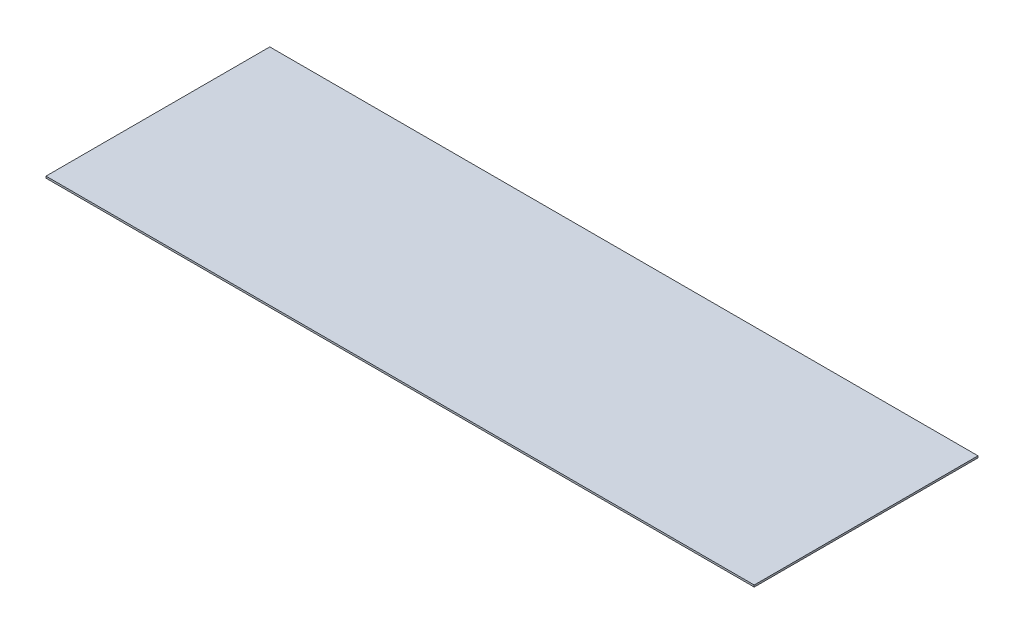
ISO-10303-21;
HEADER;
FILE_DESCRIPTION(('STEP AP214'),'2;1');
FILE_NAME('part.step','',(''),(''),'','','');
FILE_SCHEMA(('AUTOMOTIVE_DESIGN { 1 0 10303 214 1 1 1 1 }'));
ENDSEC;
DATA;
#1=APPLICATION_CONTEXT('core data for automotive mechanical design processes');
#2=APPLICATION_PROTOCOL_DEFINITION('international standard','automotive_design',2000,#1);
#3=PRODUCT_CONTEXT('',#1,'mechanical');
#4=PRODUCT('Part','Part','',(#3));
#5=PRODUCT_RELATED_PRODUCT_CATEGORY('part','',(#4));
#6=PRODUCT_DEFINITION_FORMATION('','',#4);
#7=PRODUCT_DEFINITION_CONTEXT('part definition',#1,'design');
#8=PRODUCT_DEFINITION('design','',#6,#7);
#9=PRODUCT_DEFINITION_SHAPE('','',#8);
#10=(LENGTH_UNIT() NAMED_UNIT(*) SI_UNIT(.MILLI.,.METRE.));
#11=(NAMED_UNIT(*) PLANE_ANGLE_UNIT() SI_UNIT($,.RADIAN.));
#12=(NAMED_UNIT(*) SI_UNIT($,.STERADIAN.) SOLID_ANGLE_UNIT());
#13=UNCERTAINTY_MEASURE_WITH_UNIT(LENGTH_MEASURE(1.E-05),#10,'distance_accuracy_value','');
#14=(GEOMETRIC_REPRESENTATION_CONTEXT(3) GLOBAL_UNCERTAINTY_ASSIGNED_CONTEXT((#13)) GLOBAL_UNIT_ASSIGNED_CONTEXT((#10,
#11,#12)) REPRESENTATION_CONTEXT('',''));
#15=CARTESIAN_POINT('',(0.,0.,0.));
#16=DIRECTION('',(0.,0.,1.));
#17=DIRECTION('',(1.,0.,0.));
#18=AXIS2_PLACEMENT_3D('',#15,#16,#17);
#19=CARTESIAN_POINT('',(-609.4095,1.94289029309402E-13,193.675));
#20=DIRECTION('',(0.,-1.,0.));
#21=DIRECTION('',(0.,0.,-1.));
#22=AXIS2_PLACEMENT_3D('',#19,#20,#21);
#23=PLANE('',#22);
#24=DIRECTION('',(1.,0.,0.));
#25=VECTOR('',#24,1.);
#26=CARTESIAN_POINT('',(-609.406717173755,1.94289029309402E-13,0.));
#27=LINE('',#26,#25);
#28=CARTESIAN_POINT('',(3.55600000000012,1.94289029309402E-13,0.));
#29=VERTEX_POINT('',#28);
#30=CARTESIAN_POINT('',(-1222.375,1.94289029309402E-13,0.));
#31=VERTEX_POINT('',#30);
#32=EDGE_CURVE('E78',#29,#31,#27,.F.);
#33=ORIENTED_EDGE('',*,*,#32,.T.);
#34=DIRECTION('',(0.,0.,-1.));
#35=VECTOR('',#34,1.);
#36=CARTESIAN_POINT('',(-1222.375,1.94289029309402E-13,193.675));
#37=LINE('',#36,#35);
#38=CARTESIAN_POINT('',(-1222.375,1.94289029309402E-13,387.35));
#39=VERTEX_POINT('',#38);
#40=EDGE_CURVE('E58',#31,#39,#37,.F.);
#41=ORIENTED_EDGE('',*,*,#40,.T.);
#42=DIRECTION('',(1.,0.,0.));
#43=VECTOR('',#42,1.);
#44=CARTESIAN_POINT('',(-609.406717173755,1.94289029309402E-13,387.35));
#45=LINE('',#44,#43);
#46=CARTESIAN_POINT('',(3.55600000000011,1.94289029309402E-13,387.35));
#47=VERTEX_POINT('',#46);
#48=EDGE_CURVE('E52',#47,#39,#45,.F.);
#49=ORIENTED_EDGE('',*,*,#48,.F.);
#50=DIRECTION('',(0.,0.,-1.));
#51=VECTOR('',#50,1.);
#52=CARTESIAN_POINT('',(3.55600000000011,1.94289029309402E-13,193.675));
#53=LINE('',#52,#51);
#54=EDGE_CURVE('E17',#29,#47,#53,.F.);
#55=ORIENTED_EDGE('',*,*,#54,.F.);
#56=EDGE_LOOP('',(#33,#41,#49,#55));
#57=FACE_BOUND('',#56,.T.);
#58=ADVANCED_FACE('F14',(#57),#23,.F.);
#59=CARTESIAN_POINT('',(3.55600000000011,-3.1749999999998,193.675));
#60=DIRECTION('',(1.,0.,0.));
#61=DIRECTION('',(0.,0.,-1.));
#62=AXIS2_PLACEMENT_3D('',#59,#60,#61);
#63=PLANE('',#62);
#64=DIRECTION('',(0.,0.,-1.));
#65=VECTOR('',#64,1.);
#66=CARTESIAN_POINT('',(3.55600000000011,-3.1749999999998,193.675));
#67=LINE('',#66,#65);
#68=CARTESIAN_POINT('',(3.55600000000012,-3.1749999999998,0.));
#69=VERTEX_POINT('',#68);
#70=CARTESIAN_POINT('',(3.55600000000011,-3.1749999999998,387.35));
#71=VERTEX_POINT('',#70);
#72=EDGE_CURVE('E80',#69,#71,#67,.F.);
#73=ORIENTED_EDGE('',*,*,#72,.F.);
#74=DIRECTION('',(0.,1.,0.));
#75=VECTOR('',#74,1.);
#76=CARTESIAN_POINT('',(3.55600000000011,-3.1749999999998,0.));
#77=LINE('',#76,#75);
#78=EDGE_CURVE('E65',#69,#29,#77,.T.);
#79=ORIENTED_EDGE('',*,*,#78,.T.);
#80=ORIENTED_EDGE('',*,*,#54,.T.);
#81=DIRECTION('',(0.,1.,0.));
#82=VECTOR('',#81,1.);
#83=CARTESIAN_POINT('',(3.55600000000011,-3.1749999999998,387.35));
#84=LINE('',#83,#82);
#85=EDGE_CURVE('E60',#71,#47,#84,.T.);
#86=ORIENTED_EDGE('',*,*,#85,.F.);
#87=EDGE_LOOP('',(#73,#79,#80,#86));
#88=FACE_BOUND('',#87,.T.);
#89=ADVANCED_FACE('F62',(#88),#63,.T.);
#90=CARTESIAN_POINT('',(-609.406717173755,-3.1749999999998,387.35));
#91=DIRECTION('',(0.,0.,1.));
#92=DIRECTION('',(1.,0.,0.));
#93=AXIS2_PLACEMENT_3D('',#90,#91,#92);
#94=PLANE('',#93);
#95=DIRECTION('',(1.,0.,0.));
#96=VECTOR('',#95,1.);
#97=CARTESIAN_POINT('',(-609.4095,-3.1749999999998,387.35));
#98=LINE('',#97,#96);
#99=CARTESIAN_POINT('',(-1222.375,-3.1749999999998,387.35));
#100=VERTEX_POINT('',#99);
#101=EDGE_CURVE('E69',#71,#100,#98,.F.);
#102=ORIENTED_EDGE('',*,*,#101,.F.);
#103=ORIENTED_EDGE('',*,*,#85,.T.);
#104=ORIENTED_EDGE('',*,*,#48,.T.);
#105=DIRECTION('',(0.,1.,0.));
#106=VECTOR('',#105,1.);
#107=CARTESIAN_POINT('',(-1222.375,-3.1749999999998,387.35));
#108=LINE('',#107,#106);
#109=EDGE_CURVE('E71',#39,#100,#108,.F.);
#110=ORIENTED_EDGE('',*,*,#109,.T.);
#111=EDGE_LOOP('',(#102,#103,#104,#110));
#112=FACE_BOUND('',#111,.T.);
#113=ADVANCED_FACE('F67',(#112),#94,.T.);
#114=CARTESIAN_POINT('',(-1222.375,-3.1749999999998,193.675));
#115=DIRECTION('',(1.,0.,0.));
#116=DIRECTION('',(0.,0.,-1.));
#117=AXIS2_PLACEMENT_3D('',#114,#115,#116);
#118=PLANE('',#117);
#119=DIRECTION('',(0.,1.,0.));
#120=VECTOR('',#119,1.);
#121=CARTESIAN_POINT('',(-1222.375,-3.1749999999998,0.));
#122=LINE('',#121,#120);
#123=CARTESIAN_POINT('',(-1222.375,-3.1749999999998,0.));
#124=VERTEX_POINT('',#123);
#125=EDGE_CURVE('E32',#31,#124,#122,.F.);
#126=ORIENTED_EDGE('',*,*,#125,.T.);
#127=DIRECTION('',(0.,0.,-1.));
#128=VECTOR('',#127,1.);
#129=CARTESIAN_POINT('',(-1222.375,-3.1749999999998,193.675));
#130=LINE('',#129,#128);
#131=EDGE_CURVE('E23',#100,#124,#130,.T.);
#132=ORIENTED_EDGE('',*,*,#131,.F.);
#133=ORIENTED_EDGE('',*,*,#109,.F.);
#134=ORIENTED_EDGE('',*,*,#40,.F.);
#135=EDGE_LOOP('',(#126,#132,#133,#134));
#136=FACE_BOUND('',#135,.T.);
#137=ADVANCED_FACE('F86',(#136),#118,.F.);
#138=CARTESIAN_POINT('',(-609.406717173755,-3.1749999999998,0.));
#139=DIRECTION('',(0.,0.,1.));
#140=DIRECTION('',(1.,0.,0.));
#141=AXIS2_PLACEMENT_3D('',#138,#139,#140);
#142=PLANE('',#141);
#143=ORIENTED_EDGE('',*,*,#78,.F.);
#144=DIRECTION('',(1.,0.,0.));
#145=VECTOR('',#144,1.);
#146=CARTESIAN_POINT('',(-609.4095,-3.1749999999998,0.));
#147=LINE('',#146,#145);
#148=EDGE_CURVE('E9',#124,#69,#147,.T.);
#149=ORIENTED_EDGE('',*,*,#148,.F.);
#150=ORIENTED_EDGE('',*,*,#125,.F.);
#151=ORIENTED_EDGE('',*,*,#32,.F.);
#152=EDGE_LOOP('',(#143,#149,#150,#151));
#153=FACE_BOUND('',#152,.T.);
#154=ADVANCED_FACE('F88',(#153),#142,.F.);
#155=CARTESIAN_POINT('',(-609.4095,-3.1749999999998,193.675));
#156=DIRECTION('',(0.,-1.,0.));
#157=DIRECTION('',(0.,0.,-1.));
#158=AXIS2_PLACEMENT_3D('',#155,#156,#157);
#159=PLANE('',#158);
#160=ORIENTED_EDGE('',*,*,#131,.T.);
#161=ORIENTED_EDGE('',*,*,#148,.T.);
#162=ORIENTED_EDGE('',*,*,#72,.T.);
#163=ORIENTED_EDGE('',*,*,#101,.T.);
#164=EDGE_LOOP('',(#160,#161,#162,#163));
#165=FACE_BOUND('',#164,.T.);
#166=ADVANCED_FACE('F85',(#165),#159,.T.);
#167=CLOSED_SHELL('',(#58,#89,#113,#137,#154,#166));
#168=MANIFOLD_SOLID_BREP('B1',#167);
#169=ADVANCED_BREP_SHAPE_REPRESENTATION('',(#18,#168),#14);
#170=SHAPE_DEFINITION_REPRESENTATION(#9,#169);
ENDSEC;
END-ISO-10303-21;
